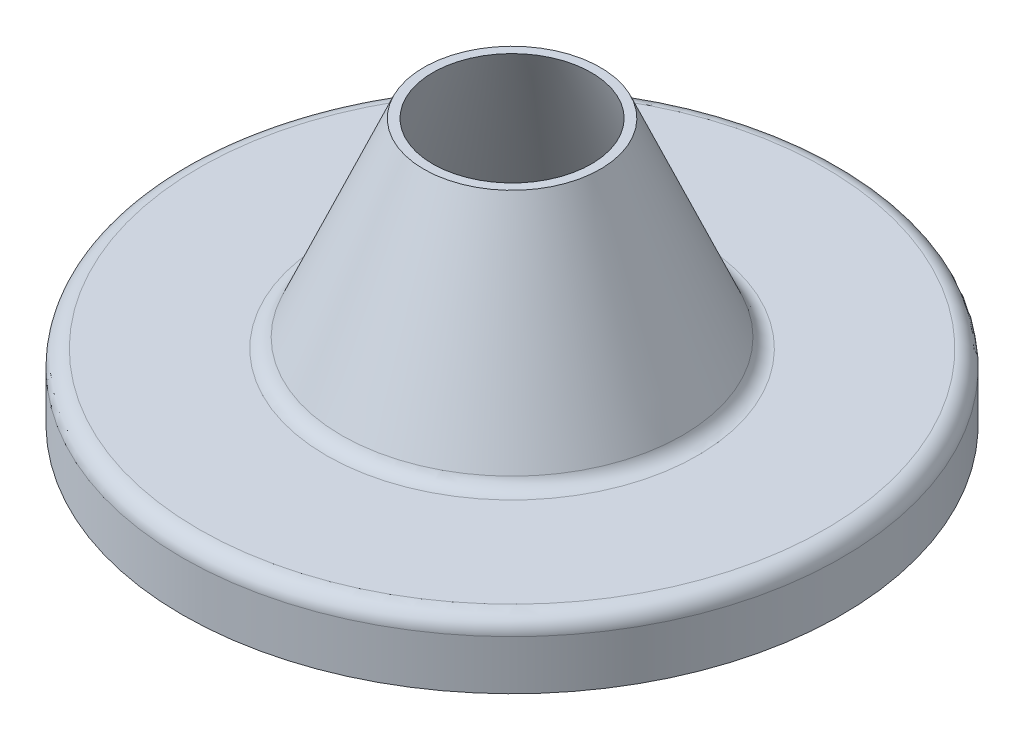
ISO-10303-21;
HEADER;
FILE_DESCRIPTION(('STEP AP214'),'2;1');
FILE_NAME('part.step','',(''),(''),'','','');
FILE_SCHEMA(('AUTOMOTIVE_DESIGN { 1 0 10303 214 1 1 1 1 }'));
ENDSEC;
DATA;
#1=APPLICATION_CONTEXT('core data for automotive mechanical design processes');
#2=APPLICATION_PROTOCOL_DEFINITION('international standard','automotive_design',2000,#1);
#3=PRODUCT_CONTEXT('',#1,'mechanical');
#4=PRODUCT('Part','Part','',(#3));
#5=PRODUCT_RELATED_PRODUCT_CATEGORY('part','',(#4));
#6=PRODUCT_DEFINITION_FORMATION('','',#4);
#7=PRODUCT_DEFINITION_CONTEXT('part definition',#1,'design');
#8=PRODUCT_DEFINITION('design','',#6,#7);
#9=PRODUCT_DEFINITION_SHAPE('','',#8);
#10=(LENGTH_UNIT() NAMED_UNIT(*) SI_UNIT(.MILLI.,.METRE.));
#11=(NAMED_UNIT(*) PLANE_ANGLE_UNIT() SI_UNIT($,.RADIAN.));
#12=(NAMED_UNIT(*) SI_UNIT($,.STERADIAN.) SOLID_ANGLE_UNIT());
#13=UNCERTAINTY_MEASURE_WITH_UNIT(LENGTH_MEASURE(1.E-05),#10,'distance_accuracy_value','');
#14=(GEOMETRIC_REPRESENTATION_CONTEXT(3) GLOBAL_UNCERTAINTY_ASSIGNED_CONTEXT((#13)) GLOBAL_UNIT_ASSIGNED_CONTEXT((#10,
#11,#12)) REPRESENTATION_CONTEXT('',''));
#15=CARTESIAN_POINT('',(0.,0.,0.));
#16=DIRECTION('',(0.,0.,1.));
#17=DIRECTION('',(1.,0.,0.));
#18=AXIS2_PLACEMENT_3D('',#15,#16,#17);
#19=CARTESIAN_POINT('',(4.875,-5.82657926102502,0.));
#20=DIRECTION('',(0.,1.,0.));
#21=DIRECTION('',(0.,0.,1.));
#22=AXIS2_PLACEMENT_3D('',#19,#20,#21);
#23=PLANE('',#22);
#24=CARTESIAN_POINT('',(0.,-5.82657926102502,0.));
#25=DIRECTION('',(0.,1.,0.));
#26=DIRECTION('',(0.,0.,1.));
#27=AXIS2_PLACEMENT_3D('',#24,#25,#26);
#28=CIRCLE('',#27,5.);
#29=CARTESIAN_POINT('',(0.,-5.82657926102502,5.));
#30=VERTEX_POINT('',#29);
#31=EDGE_CURVE('E10',#30,#30,#28,.T.);
#32=ORIENTED_EDGE('',*,*,#31,.F.);
#33=EDGE_LOOP('',(#32));
#34=FACE_BOUND('',#33,.T.);
#35=CARTESIAN_POINT('',(0.,-5.82657926102502,0.));
#36=DIRECTION('',(0.,1.,0.));
#37=DIRECTION('',(0.,0.,1.));
#38=AXIS2_PLACEMENT_3D('',#35,#36,#37);
#39=CIRCLE('',#38,4.875);
#40=CARTESIAN_POINT('',(0.,-5.82657926102502,4.875));
#41=VERTEX_POINT('',#40);
#42=EDGE_CURVE('E76',#41,#41,#39,.T.);
#43=ORIENTED_EDGE('',*,*,#42,.T.);
#44=EDGE_LOOP('',(#43));
#45=FACE_BOUND('',#44,.T.);
#46=ADVANCED_FACE('F36',(#34,#45),#23,.F.);
#47=CARTESIAN_POINT('',(0.,35.6402264600715,0.));
#48=DIRECTION('',(0.,1.,0.));
#49=DIRECTION('',(0.,0.,1.));
#50=AXIS2_PLACEMENT_3D('',#47,#48,#49);
#51=CYLINDRICAL_SURFACE('',#50,5.);
#52=CARTESIAN_POINT('',(0.,-5.07657926102502,0.));
#53=DIRECTION('',(0.,1.,0.));
#54=DIRECTION('',(0.,0.,1.));
#55=AXIS2_PLACEMENT_3D('',#52,#53,#54);
#56=CIRCLE('',#55,5.);
#57=CARTESIAN_POINT('',(0.,-5.07657926102502,5.));
#58=VERTEX_POINT('',#57);
#59=EDGE_CURVE('E42',#58,#58,#56,.T.);
#60=ORIENTED_EDGE('',*,*,#59,.F.);
#61=EDGE_LOOP('',(#60));
#62=FACE_BOUND('',#61,.T.);
#63=ORIENTED_EDGE('',*,*,#31,.T.);
#64=EDGE_LOOP('',(#63));
#65=FACE_BOUND('',#64,.T.);
#66=ADVANCED_FACE('F137',(#62,#65),#51,.T.);
#67=CARTESIAN_POINT('',(0.,-5.07657926102502,0.));
#68=DIRECTION('',(0.,1.,0.));
#69=DIRECTION('',(0.,0.,1.));
#70=AXIS2_PLACEMENT_3D('',#67,#68,#69);
#71=TOROIDAL_SURFACE('',#70,4.75,0.250000000000001);
#72=CARTESIAN_POINT('',(0.,-4.82657926102502,0.));
#73=DIRECTION('',(0.,1.,0.));
#74=DIRECTION('',(0.,0.,1.));
#75=AXIS2_PLACEMENT_3D('',#72,#73,#74);
#76=CIRCLE('',#75,4.75);
#77=CARTESIAN_POINT('',(0.,-4.82657926102502,4.75));
#78=VERTEX_POINT('',#77);
#79=EDGE_CURVE('E46',#78,#78,#76,.T.);
#80=ORIENTED_EDGE('',*,*,#79,.F.);
#81=EDGE_LOOP('',(#80));
#82=FACE_BOUND('',#81,.T.);
#83=ORIENTED_EDGE('',*,*,#59,.T.);
#84=EDGE_LOOP('',(#83));
#85=FACE_BOUND('',#84,.T.);
#86=ADVANCED_FACE('F132',(#82,#85),#71,.T.);
#87=CARTESIAN_POINT('',(4.75,-4.82657926102502,0.));
#88=DIRECTION('',(0.,-1.,0.));
#89=DIRECTION('',(0.,0.,-1.));
#90=AXIS2_PLACEMENT_3D('',#87,#88,#89);
#91=PLANE('',#90);
#92=CARTESIAN_POINT('',(0.,-4.82657926102503,0.));
#93=DIRECTION('',(0.,1.,0.));
#94=DIRECTION('',(0.,0.,1.));
#95=AXIS2_PLACEMENT_3D('',#92,#93,#94);
#96=CIRCLE('',#95,2.8141297120712);
#97=CARTESIAN_POINT('',(0.,-4.82657926102503,2.8141297120712));
#98=VERTEX_POINT('',#97);
#99=EDGE_CURVE('E50',#98,#98,#96,.T.);
#100=ORIENTED_EDGE('',*,*,#99,.F.);
#101=EDGE_LOOP('',(#100));
#102=FACE_BOUND('',#101,.T.);
#103=ORIENTED_EDGE('',*,*,#79,.T.);
#104=EDGE_LOOP('',(#103));
#105=FACE_BOUND('',#104,.T.);
#106=ADVANCED_FACE('F126',(#102,#105),#91,.F.);
#107=CARTESIAN_POINT('',(0.,-4.57657926102502,0.));
#108=DIRECTION('',(0.,1.,0.));
#109=DIRECTION('',(0.,0.,1.));
#110=AXIS2_PLACEMENT_3D('',#107,#108,#109);
#111=TOROIDAL_SURFACE('',#110,2.8141297120712,0.250000000000001);
#112=CARTESIAN_POINT('',(0.,-4.67598114879063,0.));
#113=DIRECTION('',(0.,1.,0.));
#114=DIRECTION('',(0.,0.,1.));
#115=AXIS2_PLACEMENT_3D('',#112,#113,#114);
#116=CIRCLE('',#115,2.58474081803176);
#117=CARTESIAN_POINT('',(0.,-4.67598114879063,2.58474081803176));
#118=VERTEX_POINT('',#117);
#119=EDGE_CURVE('E55',#118,#118,#116,.T.);
#120=ORIENTED_EDGE('',*,*,#119,.F.);
#121=EDGE_LOOP('',(#120));
#122=FACE_BOUND('',#121,.T.);
#123=ORIENTED_EDGE('',*,*,#99,.T.);
#124=EDGE_LOOP('',(#123));
#125=FACE_BOUND('',#124,.T.);
#126=ADVANCED_FACE('F120',(#122,#125),#111,.F.);
#127=CARTESIAN_POINT('',(0.,-4.67598114879063,0.));
#128=DIRECTION('',(0.,-1.,0.));
#129=DIRECTION('',(0.,0.,-1.));
#130=AXIS2_PLACEMENT_3D('',#127,#128,#129);
#131=CONICAL_SURFACE('',#130,2.58474081803176,0.408907952570808);
#132=CARTESIAN_POINT('',(0.,-1.80098130477509,0.));
#133=DIRECTION('',(0.,1.,0.));
#134=DIRECTION('',(0.,0.,1.));
#135=AXIS2_PLACEMENT_3D('',#132,#133,#134);
#136=CIRCLE('',#135,1.33890713014697);
#137=CARTESIAN_POINT('',(0.,-1.80098130477509,1.33890713014697));
#138=VERTEX_POINT('',#137);
#139=EDGE_CURVE('E58',#138,#138,#136,.T.);
#140=ORIENTED_EDGE('',*,*,#139,.F.);
#141=EDGE_LOOP('',(#140));
#142=FACE_BOUND('',#141,.T.);
#143=ORIENTED_EDGE('',*,*,#119,.T.);
#144=EDGE_LOOP('',(#143));
#145=FACE_BOUND('',#144,.T.);
#146=ADVANCED_FACE('F114',(#142,#145),#131,.T.);
#147=CARTESIAN_POINT('',(1.20267560014697,-1.80098130477509,0.));
#148=DIRECTION('',(0.,-1.,0.));
#149=DIRECTION('',(0.,0.,-1.));
#150=AXIS2_PLACEMENT_3D('',#147,#148,#149);
#151=PLANE('',#150);
#152=CARTESIAN_POINT('',(0.,-1.80098130477509,0.));
#153=DIRECTION('',(0.,1.,0.));
#154=DIRECTION('',(0.,0.,1.));
#155=AXIS2_PLACEMENT_3D('',#152,#153,#154);
#156=CIRCLE('',#155,1.20267560014697);
#157=CARTESIAN_POINT('',(0.,-1.80098130477509,1.20267560014697));
#158=VERTEX_POINT('',#157);
#159=EDGE_CURVE('E61',#158,#158,#156,.T.);
#160=ORIENTED_EDGE('',*,*,#159,.F.);
#161=EDGE_LOOP('',(#160));
#162=FACE_BOUND('',#161,.T.);
#163=ORIENTED_EDGE('',*,*,#139,.T.);
#164=EDGE_LOOP('',(#163));
#165=FACE_BOUND('',#164,.T.);
#166=ADVANCED_FACE('F108',(#162,#165),#151,.F.);
#167=CARTESIAN_POINT('',(0.,-1.80098130477509,0.));
#168=DIRECTION('',(0.,-1.,0.));
#169=DIRECTION('',(0.,0.,-1.));
#170=AXIS2_PLACEMENT_3D('',#167,#168,#169);
#171=CONICAL_SURFACE('',#170,1.20267560014697,0.408907952570807);
#172=CARTESIAN_POINT('',(0.,-4.80098114879063,0.));
#173=DIRECTION('',(0.,1.,0.));
#174=DIRECTION('',(0.,0.,1.));
#175=AXIS2_PLACEMENT_3D('',#172,#173,#174);
#176=CIRCLE('',#175,2.50267597305255);
#177=CARTESIAN_POINT('',(0.,-4.80098114879063,2.50267597305255));
#178=VERTEX_POINT('',#177);
#179=EDGE_CURVE('E64',#178,#178,#176,.T.);
#180=ORIENTED_EDGE('',*,*,#179,.F.);
#181=EDGE_LOOP('',(#180));
#182=FACE_BOUND('',#181,.T.);
#183=ORIENTED_EDGE('',*,*,#159,.T.);
#184=EDGE_LOOP('',(#183));
#185=FACE_BOUND('',#184,.T.);
#186=ADVANCED_FACE('F102',(#182,#185),#171,.F.);
#187=CARTESIAN_POINT('',(0.,-4.70157926102502,0.));
#188=DIRECTION('',(0.,1.,0.));
#189=DIRECTION('',(0.,0.,1.));
#190=AXIS2_PLACEMENT_3D('',#187,#188,#189);
#191=TOROIDAL_SURFACE('',#190,2.73206486709198,0.25);
#192=CARTESIAN_POINT('',(0.,-4.95157926102502,0.));
#193=DIRECTION('',(0.,1.,0.));
#194=DIRECTION('',(0.,0.,1.));
#195=AXIS2_PLACEMENT_3D('',#192,#193,#194);
#196=CIRCLE('',#195,2.73206486709198);
#197=CARTESIAN_POINT('',(0.,-4.95157926102502,2.73206486709198));
#198=VERTEX_POINT('',#197);
#199=EDGE_CURVE('E67',#198,#198,#196,.T.);
#200=ORIENTED_EDGE('',*,*,#199,.F.);
#201=EDGE_LOOP('',(#200));
#202=FACE_BOUND('',#201,.T.);
#203=ORIENTED_EDGE('',*,*,#179,.T.);
#204=EDGE_LOOP('',(#203));
#205=FACE_BOUND('',#204,.T.);
#206=ADVANCED_FACE('F96',(#202,#205),#191,.T.);
#207=CARTESIAN_POINT('',(4.625,-4.95157926102502,0.));
#208=DIRECTION('',(0.,1.,0.));
#209=DIRECTION('',(0.,0.,1.));
#210=AXIS2_PLACEMENT_3D('',#207,#208,#209);
#211=PLANE('',#210);
#212=CARTESIAN_POINT('',(0.,-4.95157926102503,0.));
#213=DIRECTION('',(0.,1.,0.));
#214=DIRECTION('',(0.,0.,1.));
#215=AXIS2_PLACEMENT_3D('',#212,#213,#214);
#216=CIRCLE('',#215,4.625);
#217=CARTESIAN_POINT('',(0.,-4.95157926102503,4.625));
#218=VERTEX_POINT('',#217);
#219=EDGE_CURVE('E70',#218,#218,#216,.T.);
#220=ORIENTED_EDGE('',*,*,#219,.F.);
#221=EDGE_LOOP('',(#220));
#222=FACE_BOUND('',#221,.T.);
#223=ORIENTED_EDGE('',*,*,#199,.T.);
#224=EDGE_LOOP('',(#223));
#225=FACE_BOUND('',#224,.T.);
#226=ADVANCED_FACE('F90',(#222,#225),#211,.F.);
#227=CARTESIAN_POINT('',(0.,-5.20157926102502,0.));
#228=DIRECTION('',(0.,1.,0.));
#229=DIRECTION('',(0.,0.,1.));
#230=AXIS2_PLACEMENT_3D('',#227,#228,#229);
#231=TOROIDAL_SURFACE('',#230,4.625,0.25);
#232=CARTESIAN_POINT('',(0.,-5.20157926102503,0.));
#233=DIRECTION('',(0.,1.,0.));
#234=DIRECTION('',(0.,0.,1.));
#235=AXIS2_PLACEMENT_3D('',#232,#233,#234);
#236=CIRCLE('',#235,4.875);
#237=CARTESIAN_POINT('',(0.,-5.20157926102503,4.875));
#238=VERTEX_POINT('',#237);
#239=EDGE_CURVE('E73',#238,#238,#236,.T.);
#240=ORIENTED_EDGE('',*,*,#239,.F.);
#241=EDGE_LOOP('',(#240));
#242=FACE_BOUND('',#241,.T.);
#243=ORIENTED_EDGE('',*,*,#219,.T.);
#244=EDGE_LOOP('',(#243));
#245=FACE_BOUND('',#244,.T.);
#246=ADVANCED_FACE('F84',(#242,#245),#231,.F.);
#247=CARTESIAN_POINT('',(0.,35.6402264600715,0.));
#248=DIRECTION('',(0.,1.,0.));
#249=DIRECTION('',(0.,0.,1.));
#250=AXIS2_PLACEMENT_3D('',#247,#248,#249);
#251=CYLINDRICAL_SURFACE('',#250,4.875);
#252=ORIENTED_EDGE('',*,*,#42,.F.);
#253=EDGE_LOOP('',(#252));
#254=FACE_BOUND('',#253,.T.);
#255=ORIENTED_EDGE('',*,*,#239,.T.);
#256=EDGE_LOOP('',(#255));
#257=FACE_BOUND('',#256,.T.);
#258=ADVANCED_FACE('F81',(#254,#257),#251,.F.);
#259=CLOSED_SHELL('',(#46,#66,#86,#106,#126,#146,#166,#186,#206,#226,#246,#258));
#260=MANIFOLD_SOLID_BREP('B2',#259);
#261=ADVANCED_BREP_SHAPE_REPRESENTATION('',(#18,#260),#14);
#262=SHAPE_DEFINITION_REPRESENTATION(#9,#261);
ENDSEC;
END-ISO-10303-21;
